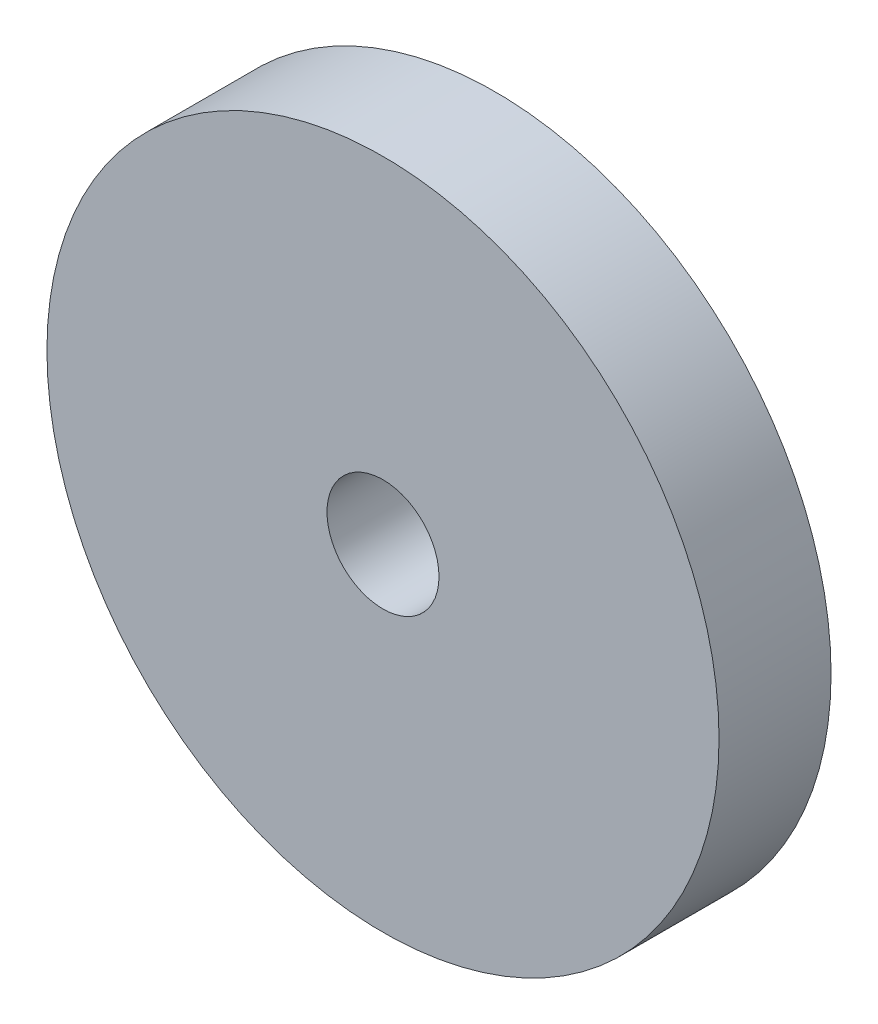
ISO-10303-21;
HEADER;
FILE_DESCRIPTION(('STEP AP214'),'2;1');
FILE_NAME('part.step','',(''),(''),'','','');
FILE_SCHEMA(('AUTOMOTIVE_DESIGN { 1 0 10303 214 1 1 1 1 }'));
ENDSEC;
DATA;
#1=APPLICATION_CONTEXT('core data for automotive mechanical design processes');
#2=APPLICATION_PROTOCOL_DEFINITION('international standard','automotive_design',2000,#1);
#3=PRODUCT_CONTEXT('',#1,'mechanical');
#4=PRODUCT('Part','Part','',(#3));
#5=PRODUCT_RELATED_PRODUCT_CATEGORY('part','',(#4));
#6=PRODUCT_DEFINITION_FORMATION('','',#4);
#7=PRODUCT_DEFINITION_CONTEXT('part definition',#1,'design');
#8=PRODUCT_DEFINITION('design','',#6,#7);
#9=PRODUCT_DEFINITION_SHAPE('','',#8);
#10=(LENGTH_UNIT() NAMED_UNIT(*) SI_UNIT(.MILLI.,.METRE.));
#11=(NAMED_UNIT(*) PLANE_ANGLE_UNIT() SI_UNIT($,.RADIAN.));
#12=(NAMED_UNIT(*) SI_UNIT($,.STERADIAN.) SOLID_ANGLE_UNIT());
#13=UNCERTAINTY_MEASURE_WITH_UNIT(LENGTH_MEASURE(1.E-05),#10,'distance_accuracy_value','');
#14=(GEOMETRIC_REPRESENTATION_CONTEXT(3) GLOBAL_UNCERTAINTY_ASSIGNED_CONTEXT((#13)) GLOBAL_UNIT_ASSIGNED_CONTEXT((#10,
#11,#12)) REPRESENTATION_CONTEXT('',''));
#15=CARTESIAN_POINT('',(0.,0.,0.));
#16=DIRECTION('',(0.,0.,1.));
#17=DIRECTION('',(1.,0.,0.));
#18=AXIS2_PLACEMENT_3D('',#15,#16,#17);
#19=CARTESIAN_POINT('',(882.5,56.5,3.));
#20=DIRECTION('',(0.,0.,-1.));
#21=DIRECTION('',(-1.,0.,0.));
#22=AXIS2_PLACEMENT_3D('',#19,#20,#21);
#23=CYLINDRICAL_SURFACE('',#22,1.5);
#24=CARTESIAN_POINT('',(882.5,56.5,3.));
#25=DIRECTION('',(0.,0.,1.));
#26=DIRECTION('',(1.,0.,0.));
#27=AXIS2_PLACEMENT_3D('',#24,#25,#26);
#28=CIRCLE('',#27,1.5);
#29=CARTESIAN_POINT('',(884.,56.5,3.));
#30=VERTEX_POINT('',#29);
#31=EDGE_CURVE('E41',#30,#30,#28,.T.);
#32=ORIENTED_EDGE('',*,*,#31,.T.);
#33=EDGE_LOOP('',(#32));
#34=FACE_BOUND('',#33,.T.);
#35=CARTESIAN_POINT('',(882.5,56.5,0.));
#36=DIRECTION('',(0.,0.,1.));
#37=DIRECTION('',(1.,0.,0.));
#38=AXIS2_PLACEMENT_3D('',#35,#36,#37);
#39=CIRCLE('',#38,1.5);
#40=CARTESIAN_POINT('',(884.,56.5,0.));
#41=VERTEX_POINT('',#40);
#42=EDGE_CURVE('E47',#41,#41,#39,.T.);
#43=ORIENTED_EDGE('',*,*,#42,.F.);
#44=EDGE_LOOP('',(#43));
#45=FACE_BOUND('',#44,.T.);
#46=ADVANCED_FACE('F34',(#34,#45),#23,.F.);
#47=CARTESIAN_POINT('',(882.5,56.5,3.));
#48=DIRECTION('',(0.,0.,-1.));
#49=DIRECTION('',(-1.,0.,0.));
#50=AXIS2_PLACEMENT_3D('',#47,#48,#49);
#51=CYLINDRICAL_SURFACE('',#50,9.);
#52=CARTESIAN_POINT('',(882.5,56.5,3.));
#53=DIRECTION('',(0.,0.,1.));
#54=DIRECTION('',(1.,0.,0.));
#55=AXIS2_PLACEMENT_3D('',#52,#53,#54);
#56=CIRCLE('',#55,9.);
#57=CARTESIAN_POINT('',(891.5,56.5,3.));
#58=VERTEX_POINT('',#57);
#59=EDGE_CURVE('E10',#58,#58,#56,.T.);
#60=ORIENTED_EDGE('',*,*,#59,.F.);
#61=EDGE_LOOP('',(#60));
#62=FACE_BOUND('',#61,.T.);
#63=CARTESIAN_POINT('',(882.5,56.5,0.));
#64=DIRECTION('',(0.,0.,1.));
#65=DIRECTION('',(1.,0.,0.));
#66=AXIS2_PLACEMENT_3D('',#63,#64,#65);
#67=CIRCLE('',#66,9.);
#68=CARTESIAN_POINT('',(891.5,56.5,0.));
#69=VERTEX_POINT('',#68);
#70=EDGE_CURVE('E37',#69,#69,#67,.T.);
#71=ORIENTED_EDGE('',*,*,#70,.T.);
#72=EDGE_LOOP('',(#71));
#73=FACE_BOUND('',#72,.T.);
#74=ADVANCED_FACE('F54',(#62,#73),#51,.T.);
#75=CARTESIAN_POINT('',(0.,0.,3.));
#76=DIRECTION('',(0.,0.,1.));
#77=DIRECTION('',(1.,0.,0.));
#78=AXIS2_PLACEMENT_3D('',#75,#76,#77);
#79=PLANE('',#78);
#80=ORIENTED_EDGE('',*,*,#31,.F.);
#81=EDGE_LOOP('',(#80));
#82=FACE_BOUND('',#81,.T.);
#83=ORIENTED_EDGE('',*,*,#59,.T.);
#84=EDGE_LOOP('',(#83));
#85=FACE_BOUND('',#84,.T.);
#86=ADVANCED_FACE('F58',(#82,#85),#79,.T.);
#87=CARTESIAN_POINT('',(0.,0.,0.));
#88=DIRECTION('',(0.,0.,1.));
#89=DIRECTION('',(1.,0.,0.));
#90=AXIS2_PLACEMENT_3D('',#87,#88,#89);
#91=PLANE('',#90);
#92=ORIENTED_EDGE('',*,*,#42,.T.);
#93=EDGE_LOOP('',(#92));
#94=FACE_BOUND('',#93,.T.);
#95=ORIENTED_EDGE('',*,*,#70,.F.);
#96=EDGE_LOOP('',(#95));
#97=FACE_BOUND('',#96,.T.);
#98=ADVANCED_FACE('F56',(#94,#97),#91,.F.);
#99=CLOSED_SHELL('',(#46,#74,#86,#98));
#100=MANIFOLD_SOLID_BREP('B2',#99);
#101=ADVANCED_BREP_SHAPE_REPRESENTATION('',(#18,#100),#14);
#102=SHAPE_DEFINITION_REPRESENTATION(#9,#101);
ENDSEC;
END-ISO-10303-21;
